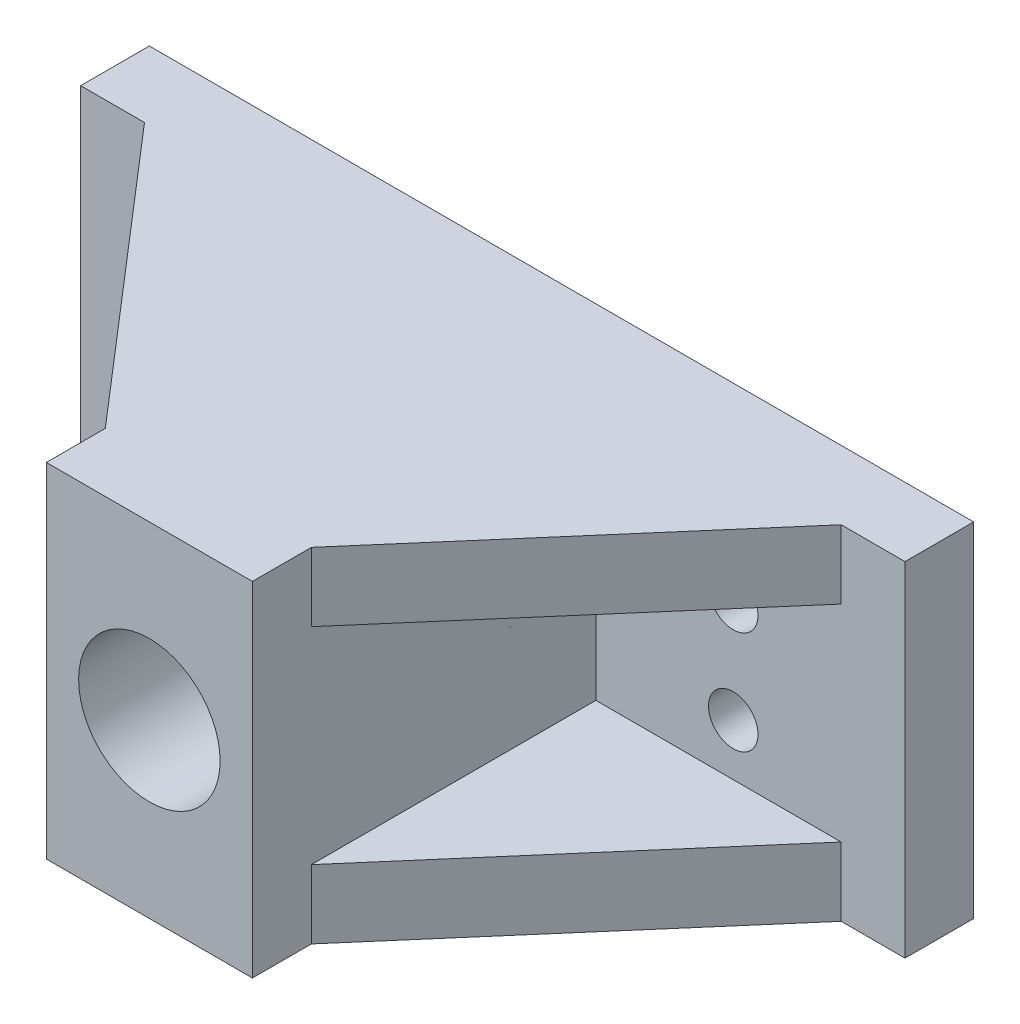
ISO-10303-21;
HEADER;
FILE_DESCRIPTION(('STEP AP214'),'2;1');
FILE_NAME('part.step','',(''),(''),'','','');
FILE_SCHEMA(('AUTOMOTIVE_DESIGN { 1 0 10303 214 1 1 1 1 }'));
ENDSEC;
DATA;
#1=APPLICATION_CONTEXT('core data for automotive mechanical design processes');
#2=APPLICATION_PROTOCOL_DEFINITION('international standard','automotive_design',2000,#1);
#3=PRODUCT_CONTEXT('',#1,'mechanical');
#4=PRODUCT('Part','Part','',(#3));
#5=PRODUCT_RELATED_PRODUCT_CATEGORY('part','',(#4));
#6=PRODUCT_DEFINITION_FORMATION('','',#4);
#7=PRODUCT_DEFINITION_CONTEXT('part definition',#1,'design');
#8=PRODUCT_DEFINITION('design','',#6,#7);
#9=PRODUCT_DEFINITION_SHAPE('','',#8);
#10=(LENGTH_UNIT() NAMED_UNIT(*) SI_UNIT(.MILLI.,.METRE.));
#11=(NAMED_UNIT(*) PLANE_ANGLE_UNIT() SI_UNIT($,.RADIAN.));
#12=(NAMED_UNIT(*) SI_UNIT($,.STERADIAN.) SOLID_ANGLE_UNIT());
#13=UNCERTAINTY_MEASURE_WITH_UNIT(LENGTH_MEASURE(1.E-05),#10,'distance_accuracy_value','');
#14=(GEOMETRIC_REPRESENTATION_CONTEXT(3) GLOBAL_UNCERTAINTY_ASSIGNED_CONTEXT((#13)) GLOBAL_UNIT_ASSIGNED_CONTEXT((#10,
#11,#12)) REPRESENTATION_CONTEXT('',''));
#15=CARTESIAN_POINT('',(0.,0.,0.));
#16=DIRECTION('',(0.,0.,1.));
#17=DIRECTION('',(1.,0.,0.));
#18=AXIS2_PLACEMENT_3D('',#15,#16,#17);
#19=CARTESIAN_POINT('',(0.,0.,5.));
#20=DIRECTION('',(0.,0.,1.));
#21=DIRECTION('',(1.,0.,0.));
#22=AXIS2_PLACEMENT_3D('',#19,#20,#21);
#23=PLANE('',#22);
#24=CARTESIAN_POINT('',(17.5,-3.75,5.));
#25=DIRECTION('',(0.,0.,1.));
#26=DIRECTION('',(1.,0.,0.));
#27=AXIS2_PLACEMENT_3D('',#24,#25,#26);
#28=CIRCLE('',#27,1.8);
#29=CARTESIAN_POINT('',(19.3,-3.75,5.));
#30=VERTEX_POINT('',#29);
#31=EDGE_CURVE('E307',#30,#30,#28,.T.);
#32=ORIENTED_EDGE('',*,*,#31,.F.);
#33=EDGE_LOOP('',(#32));
#34=FACE_BOUND('',#33,.T.);
#35=CARTESIAN_POINT('',(17.5,3.75,5.));
#36=DIRECTION('',(0.,0.,1.));
#37=DIRECTION('',(-1.,0.,0.));
#38=AXIS2_PLACEMENT_3D('',#35,#36,#37);
#39=CIRCLE('',#38,1.8);
#40=CARTESIAN_POINT('',(15.7,3.75,5.));
#41=VERTEX_POINT('',#40);
#42=EDGE_CURVE('E300',#41,#41,#39,.T.);
#43=ORIENTED_EDGE('',*,*,#42,.F.);
#44=EDGE_LOOP('',(#43));
#45=FACE_BOUND('',#44,.T.);
#46=DIRECTION('',(0.,1.,0.));
#47=VECTOR('',#46,1.);
#48=CARTESIAN_POINT('',(25.3552316545314,0.,5.));
#49=LINE('',#48,#47);
#50=CARTESIAN_POINT('',(25.3552316545314,-12.5,5.00000000000001));
#51=VERTEX_POINT('',#50);
#52=CARTESIAN_POINT('',(25.3552316545314,-7.5,5.));
#53=VERTEX_POINT('',#52);
#54=EDGE_CURVE('E278',#51,#53,#49,.T.);
#55=ORIENTED_EDGE('',*,*,#54,.F.);
#56=DIRECTION('',(1.,0.,0.));
#57=VECTOR('',#56,1.);
#58=CARTESIAN_POINT('',(-30.,-12.5,5.));
#59=LINE('',#58,#57);
#60=CARTESIAN_POINT('',(30.,-12.5,5.));
#61=VERTEX_POINT('',#60);
#62=EDGE_CURVE('E178',#51,#61,#59,.T.);
#63=ORIENTED_EDGE('',*,*,#62,.T.);
#64=DIRECTION('',(0.,1.,0.));
#65=VECTOR('',#64,1.);
#66=CARTESIAN_POINT('',(30.,7.50000000000001,5.));
#67=LINE('',#66,#65);
#68=CARTESIAN_POINT('',(30.,12.5,5.));
#69=VERTEX_POINT('',#68);
#70=EDGE_CURVE('E198',#61,#69,#67,.T.);
#71=ORIENTED_EDGE('',*,*,#70,.T.);
#72=DIRECTION('',(-1.,0.,0.));
#73=VECTOR('',#72,1.);
#74=CARTESIAN_POINT('',(-30.,12.5,5.));
#75=LINE('',#74,#73);
#76=CARTESIAN_POINT('',(25.3552316545314,12.5,5.00000000000001));
#77=VERTEX_POINT('',#76);
#78=EDGE_CURVE('E193',#69,#77,#75,.T.);
#79=ORIENTED_EDGE('',*,*,#78,.T.);
#80=DIRECTION('',(0.,-1.,0.));
#81=VECTOR('',#80,1.);
#82=CARTESIAN_POINT('',(25.3552316545314,0.,5.));
#83=LINE('',#82,#81);
#84=CARTESIAN_POINT('',(25.3552316545314,7.5,5.));
#85=VERTEX_POINT('',#84);
#86=EDGE_CURVE('E223',#85,#77,#83,.F.);
#87=ORIENTED_EDGE('',*,*,#86,.F.);
#88=DIRECTION('',(-1.,0.,0.));
#89=VECTOR('',#88,1.);
#90=CARTESIAN_POINT('',(0.,7.5,5.));
#91=LINE('',#90,#89);
#92=CARTESIAN_POINT('',(7.5,7.5,5.));
#93=VERTEX_POINT('',#92);
#94=EDGE_CURVE('E221',#85,#93,#91,.T.);
#95=ORIENTED_EDGE('',*,*,#94,.T.);
#96=DIRECTION('',(0.,1.,0.));
#97=VECTOR('',#96,1.);
#98=CARTESIAN_POINT('',(7.5,7.5,5.));
#99=LINE('',#98,#97);
#100=CARTESIAN_POINT('',(7.5,-7.5,5.));
#101=VERTEX_POINT('',#100);
#102=EDGE_CURVE('E210',#101,#93,#99,.T.);
#103=ORIENTED_EDGE('',*,*,#102,.F.);
#104=DIRECTION('',(1.,0.,0.));
#105=VECTOR('',#104,1.);
#106=CARTESIAN_POINT('',(0.,-7.5,5.));
#107=LINE('',#106,#105);
#108=EDGE_CURVE('E50',#101,#53,#107,.T.);
#109=ORIENTED_EDGE('',*,*,#108,.T.);
#110=EDGE_LOOP('',(#55,#63,#71,#79,#87,#95,#103,#109));
#111=FACE_BOUND('',#110,.T.);
#112=ADVANCED_FACE('F35',(#34,#45,#111),#23,.T.);
#113=CARTESIAN_POINT('',(-17.5,-3.75,5.));
#114=DIRECTION('',(0.,0.,1.));
#115=DIRECTION('',(-1.,0.,0.));
#116=AXIS2_PLACEMENT_3D('',#113,#114,#115);
#117=CIRCLE('',#116,1.8);
#118=CARTESIAN_POINT('',(-19.3,-3.75,5.));
#119=VERTEX_POINT('',#118);
#120=EDGE_CURVE('E313',#119,#119,#117,.T.);
#121=ORIENTED_EDGE('',*,*,#120,.F.);
#122=EDGE_LOOP('',(#121));
#123=FACE_BOUND('',#122,.T.);
#124=CARTESIAN_POINT('',(-17.5,3.75,5.));
#125=DIRECTION('',(0.,0.,1.));
#126=DIRECTION('',(1.,0.,0.));
#127=AXIS2_PLACEMENT_3D('',#124,#125,#126);
#128=CIRCLE('',#127,1.8);
#129=CARTESIAN_POINT('',(-15.7,3.75,5.));
#130=VERTEX_POINT('',#129);
#131=EDGE_CURVE('E294',#130,#130,#128,.T.);
#132=ORIENTED_EDGE('',*,*,#131,.F.);
#133=EDGE_LOOP('',(#132));
#134=FACE_BOUND('',#133,.T.);
#135=DIRECTION('',(0.,1.,0.));
#136=VECTOR('',#135,1.);
#137=CARTESIAN_POINT('',(-25.3552316545314,0.,5.));
#138=LINE('',#137,#136);
#139=CARTESIAN_POINT('',(-25.3552316545314,-7.5,5.));
#140=VERTEX_POINT('',#139);
#141=CARTESIAN_POINT('',(-25.3552316545314,-12.5,5.));
#142=VERTEX_POINT('',#141);
#143=EDGE_CURVE('E149',#140,#142,#138,.F.);
#144=ORIENTED_EDGE('',*,*,#143,.F.);
#145=DIRECTION('',(1.,0.,0.));
#146=VECTOR('',#145,1.);
#147=CARTESIAN_POINT('',(0.,-7.5,5.));
#148=LINE('',#147,#146);
#149=CARTESIAN_POINT('',(-7.5,-7.5,5.));
#150=VERTEX_POINT('',#149);
#151=EDGE_CURVE('E242',#140,#150,#148,.T.);
#152=ORIENTED_EDGE('',*,*,#151,.T.);
#153=DIRECTION('',(0.,-1.,0.));
#154=VECTOR('',#153,1.);
#155=CARTESIAN_POINT('',(-7.5,7.5,5.));
#156=LINE('',#155,#154);
#157=CARTESIAN_POINT('',(-7.5,7.5,5.));
#158=VERTEX_POINT('',#157);
#159=EDGE_CURVE('E206',#158,#150,#156,.T.);
#160=ORIENTED_EDGE('',*,*,#159,.F.);
#161=DIRECTION('',(-1.,0.,0.));
#162=VECTOR('',#161,1.);
#163=CARTESIAN_POINT('',(0.,7.5,5.));
#164=LINE('',#163,#162);
#165=CARTESIAN_POINT('',(-25.3552316545314,7.5,5.));
#166=VERTEX_POINT('',#165);
#167=EDGE_CURVE('E258',#158,#166,#164,.T.);
#168=ORIENTED_EDGE('',*,*,#167,.T.);
#169=DIRECTION('',(0.,-1.,0.));
#170=VECTOR('',#169,1.);
#171=CARTESIAN_POINT('',(-25.3552316545314,0.,5.));
#172=LINE('',#171,#170);
#173=CARTESIAN_POINT('',(-25.3552316545314,12.5,5.));
#174=VERTEX_POINT('',#173);
#175=EDGE_CURVE('E252',#174,#166,#172,.T.);
#176=ORIENTED_EDGE('',*,*,#175,.F.);
#177=CARTESIAN_POINT('',(-30.,12.5,5.));
#178=VERTEX_POINT('',#177);
#179=EDGE_CURVE('E188',#174,#178,#75,.T.);
#180=ORIENTED_EDGE('',*,*,#179,.T.);
#181=DIRECTION('',(0.,-1.,0.));
#182=VECTOR('',#181,1.);
#183=CARTESIAN_POINT('',(-30.,7.5,5.));
#184=LINE('',#183,#182);
#185=CARTESIAN_POINT('',(-30.,-12.5,5.));
#186=VERTEX_POINT('',#185);
#187=EDGE_CURVE('E175',#178,#186,#184,.T.);
#188=ORIENTED_EDGE('',*,*,#187,.T.);
#189=EDGE_CURVE('E168',#186,#142,#59,.T.);
#190=ORIENTED_EDGE('',*,*,#189,.T.);
#191=EDGE_LOOP('',(#144,#152,#160,#168,#176,#180,#188,#190));
#192=FACE_BOUND('',#191,.T.);
#193=ADVANCED_FACE('F173',(#123,#134,#192),#23,.T.);
#194=CARTESIAN_POINT('',(0.,0.,0.));
#195=DIRECTION('',(0.,0.,1.));
#196=DIRECTION('',(1.,0.,0.));
#197=AXIS2_PLACEMENT_3D('',#194,#195,#196);
#198=PLANE('',#197);
#199=CARTESIAN_POINT('',(-17.5,-3.75,0.));
#200=DIRECTION('',(0.,0.,1.));
#201=DIRECTION('',(-1.,0.,0.));
#202=AXIS2_PLACEMENT_3D('',#199,#200,#201);
#203=CIRCLE('',#202,1.8);
#204=CARTESIAN_POINT('',(-19.3,-3.75,0.));
#205=VERTEX_POINT('',#204);
#206=EDGE_CURVE('E297',#205,#205,#203,.T.);
#207=ORIENTED_EDGE('',*,*,#206,.T.);
#208=EDGE_LOOP('',(#207));
#209=FACE_BOUND('',#208,.T.);
#210=CARTESIAN_POINT('',(17.5,-3.75,0.));
#211=DIRECTION('',(0.,0.,1.));
#212=DIRECTION('',(1.,0.,0.));
#213=AXIS2_PLACEMENT_3D('',#210,#211,#212);
#214=CIRCLE('',#213,1.8);
#215=CARTESIAN_POINT('',(19.3,-3.75,0.));
#216=VERTEX_POINT('',#215);
#217=EDGE_CURVE('E310',#216,#216,#214,.T.);
#218=ORIENTED_EDGE('',*,*,#217,.T.);
#219=EDGE_LOOP('',(#218));
#220=FACE_BOUND('',#219,.T.);
#221=CARTESIAN_POINT('',(17.5,3.75,0.));
#222=DIRECTION('',(0.,0.,1.));
#223=DIRECTION('',(-1.,0.,0.));
#224=AXIS2_PLACEMENT_3D('',#221,#222,#223);
#225=CIRCLE('',#224,1.8);
#226=CARTESIAN_POINT('',(15.7,3.75,0.));
#227=VERTEX_POINT('',#226);
#228=EDGE_CURVE('E303',#227,#227,#225,.T.);
#229=ORIENTED_EDGE('',*,*,#228,.T.);
#230=EDGE_LOOP('',(#229));
#231=FACE_BOUND('',#230,.T.);
#232=CARTESIAN_POINT('',(-17.5,3.75,0.));
#233=DIRECTION('',(0.,0.,1.));
#234=DIRECTION('',(1.,0.,0.));
#235=AXIS2_PLACEMENT_3D('',#232,#233,#234);
#236=CIRCLE('',#235,1.8);
#237=CARTESIAN_POINT('',(-15.7,3.75,0.));
#238=VERTEX_POINT('',#237);
#239=EDGE_CURVE('E291',#238,#238,#236,.T.);
#240=ORIENTED_EDGE('',*,*,#239,.T.);
#241=EDGE_LOOP('',(#240));
#242=FACE_BOUND('',#241,.T.);
#243=DIRECTION('',(0.,1.,0.));
#244=VECTOR('',#243,1.);
#245=CARTESIAN_POINT('',(30.,7.50000000000001,0.));
#246=LINE('',#245,#244);
#247=CARTESIAN_POINT('',(30.,-12.5,0.));
#248=VERTEX_POINT('',#247);
#249=CARTESIAN_POINT('',(30.,12.5,0.));
#250=VERTEX_POINT('',#249);
#251=EDGE_CURVE('E201',#248,#250,#246,.T.);
#252=ORIENTED_EDGE('',*,*,#251,.F.);
#253=DIRECTION('',(1.,0.,0.));
#254=VECTOR('',#253,1.);
#255=CARTESIAN_POINT('',(-30.,-12.5,0.));
#256=LINE('',#255,#254);
#257=CARTESIAN_POINT('',(-30.,-12.5,0.));
#258=VERTEX_POINT('',#257);
#259=EDGE_CURVE('E177',#258,#248,#256,.T.);
#260=ORIENTED_EDGE('',*,*,#259,.F.);
#261=DIRECTION('',(0.,-1.,0.));
#262=VECTOR('',#261,1.);
#263=CARTESIAN_POINT('',(-30.,7.5,0.));
#264=LINE('',#263,#262);
#265=CARTESIAN_POINT('',(-30.,12.5,0.));
#266=VERTEX_POINT('',#265);
#267=EDGE_CURVE('E204',#266,#258,#264,.T.);
#268=ORIENTED_EDGE('',*,*,#267,.F.);
#269=DIRECTION('',(-1.,0.,0.));
#270=VECTOR('',#269,1.);
#271=CARTESIAN_POINT('',(-30.,12.5,0.));
#272=LINE('',#271,#270);
#273=EDGE_CURVE('E190',#250,#266,#272,.T.);
#274=ORIENTED_EDGE('',*,*,#273,.F.);
#275=EDGE_LOOP('',(#252,#260,#268,#274));
#276=FACE_BOUND('',#275,.T.);
#277=CARTESIAN_POINT('',(0.,0.,0.));
#278=DIRECTION('',(0.,0.,1.));
#279=DIRECTION('',(1.,0.,0.));
#280=AXIS2_PLACEMENT_3D('',#277,#278,#279);
#281=CIRCLE('',#280,5.15);
#282=CARTESIAN_POINT('',(5.15,0.,0.));
#283=VERTEX_POINT('',#282);
#284=EDGE_CURVE('E11',#283,#283,#281,.T.);
#285=ORIENTED_EDGE('',*,*,#284,.T.);
#286=EDGE_LOOP('',(#285));
#287=FACE_BOUND('',#286,.T.);
#288=ADVANCED_FACE('F37',(#209,#220,#231,#242,#276,#287),#198,.F.);
#289=CARTESIAN_POINT('',(0.,0.,0.));
#290=DIRECTION('',(0.,0.,1.));
#291=DIRECTION('',(1.,0.,0.));
#292=AXIS2_PLACEMENT_3D('',#289,#290,#291);
#293=CYLINDRICAL_SURFACE('',#292,5.15);
#294=ORIENTED_EDGE('',*,*,#284,.F.);
#295=EDGE_LOOP('',(#294));
#296=FACE_BOUND('',#295,.T.);
#297=CARTESIAN_POINT('',(0.,0.,30.));
#298=DIRECTION('',(0.,0.,-1.));
#299=DIRECTION('',(-1.,0.,0.));
#300=AXIS2_PLACEMENT_3D('',#297,#298,#299);
#301=CIRCLE('',#300,5.15);
#302=CARTESIAN_POINT('',(-5.15,0.,30.));
#303=VERTEX_POINT('',#302);
#304=EDGE_CURVE('E304',#303,#303,#301,.T.);
#305=ORIENTED_EDGE('',*,*,#304,.F.);
#306=EDGE_LOOP('',(#305));
#307=FACE_BOUND('',#306,.T.);
#308=ADVANCED_FACE('F323',(#296,#307),#293,.F.);
#309=CARTESIAN_POINT('',(0.,0.,30.));
#310=DIRECTION('',(0.,0.,-1.));
#311=DIRECTION('',(-1.,0.,0.));
#312=AXIS2_PLACEMENT_3D('',#309,#310,#311);
#313=PLANE('',#312);
#314=DIRECTION('',(0.,-1.,0.));
#315=VECTOR('',#314,1.);
#316=CARTESIAN_POINT('',(-7.5,7.5,30.));
#317=LINE('',#316,#315);
#318=CARTESIAN_POINT('',(-7.5,12.5,30.));
#319=VERTEX_POINT('',#318);
#320=CARTESIAN_POINT('',(-7.5,-12.5,30.));
#321=VERTEX_POINT('',#320);
#322=EDGE_CURVE('E208',#319,#321,#317,.T.);
#323=ORIENTED_EDGE('',*,*,#322,.T.);
#324=DIRECTION('',(-1.,0.,0.));
#325=VECTOR('',#324,1.);
#326=CARTESIAN_POINT('',(-7.5,-12.5,30.));
#327=LINE('',#326,#325);
#328=CARTESIAN_POINT('',(7.5,-12.5,30.));
#329=VERTEX_POINT('',#328);
#330=EDGE_CURVE('E261',#329,#321,#327,.T.);
#331=ORIENTED_EDGE('',*,*,#330,.F.);
#332=DIRECTION('',(0.,1.,0.));
#333=VECTOR('',#332,1.);
#334=CARTESIAN_POINT('',(7.5,7.5,30.));
#335=LINE('',#334,#333);
#336=CARTESIAN_POINT('',(7.5,12.5,30.));
#337=VERTEX_POINT('',#336);
#338=EDGE_CURVE('E43',#329,#337,#335,.T.);
#339=ORIENTED_EDGE('',*,*,#338,.T.);
#340=DIRECTION('',(1.,0.,0.));
#341=VECTOR('',#340,1.);
#342=CARTESIAN_POINT('',(-7.5,12.5,30.));
#343=LINE('',#342,#341);
#344=EDGE_CURVE('E182',#319,#337,#343,.T.);
#345=ORIENTED_EDGE('',*,*,#344,.F.);
#346=EDGE_LOOP('',(#323,#331,#339,#345));
#347=FACE_BOUND('',#346,.T.);
#348=ORIENTED_EDGE('',*,*,#304,.T.);
#349=EDGE_LOOP('',(#348));
#350=FACE_BOUND('',#349,.T.);
#351=ADVANCED_FACE('F321',(#347,#350),#313,.F.);
#352=CARTESIAN_POINT('',(-7.5,7.5,30.));
#353=DIRECTION('',(1.,0.,0.));
#354=DIRECTION('',(0.,1.,0.));
#355=AXIS2_PLACEMENT_3D('',#352,#353,#354);
#356=PLANE('',#355);
#357=DIRECTION('',(0.,0.,-1.));
#358=VECTOR('',#357,1.);
#359=CARTESIAN_POINT('',(-7.5,-12.5,45.8113883008419));
#360=LINE('',#359,#358);
#361=CARTESIAN_POINT('',(-7.49999999999998,-12.5,25.7076023988971));
#362=VERTEX_POINT('',#361);
#363=EDGE_CURVE('E171',#321,#362,#360,.T.);
#364=ORIENTED_EDGE('',*,*,#363,.F.);
#365=ORIENTED_EDGE('',*,*,#322,.F.);
#366=DIRECTION('',(0.,0.,-1.));
#367=VECTOR('',#366,1.);
#368=CARTESIAN_POINT('',(-7.5,12.5,45.8113883008419));
#369=LINE('',#368,#367);
#370=CARTESIAN_POINT('',(-7.49999999999999,12.5,25.7076023988971));
#371=VERTEX_POINT('',#370);
#372=EDGE_CURVE('E263',#319,#371,#369,.T.);
#373=ORIENTED_EDGE('',*,*,#372,.T.);
#374=DIRECTION('',(0.,-1.,0.));
#375=VECTOR('',#374,1.);
#376=CARTESIAN_POINT('',(-7.5,7.5,25.7076023988971));
#377=LINE('',#376,#375);
#378=CARTESIAN_POINT('',(-7.5,7.5,25.7076023988971));
#379=VERTEX_POINT('',#378);
#380=EDGE_CURVE('E248',#371,#379,#377,.T.);
#381=ORIENTED_EDGE('',*,*,#380,.T.);
#382=DIRECTION('',(0.,0.,1.));
#383=VECTOR('',#382,1.);
#384=CARTESIAN_POINT('',(-7.5,7.5,30.));
#385=LINE('',#384,#383);
#386=EDGE_CURVE('E255',#158,#379,#385,.T.);
#387=ORIENTED_EDGE('',*,*,#386,.F.);
#388=ORIENTED_EDGE('',*,*,#159,.T.);
#389=DIRECTION('',(0.,0.,-1.));
#390=VECTOR('',#389,1.);
#391=CARTESIAN_POINT('',(-7.5,-7.5,30.));
#392=LINE('',#391,#390);
#393=CARTESIAN_POINT('',(-7.5,-7.5,25.7076023988971));
#394=VERTEX_POINT('',#393);
#395=EDGE_CURVE('E159',#394,#150,#392,.T.);
#396=ORIENTED_EDGE('',*,*,#395,.F.);
#397=DIRECTION('',(0.,1.,0.));
#398=VECTOR('',#397,1.);
#399=CARTESIAN_POINT('',(-7.5,7.5,25.7076023988971));
#400=LINE('',#399,#398);
#401=EDGE_CURVE('E160',#394,#362,#400,.F.);
#402=ORIENTED_EDGE('',*,*,#401,.T.);
#403=EDGE_LOOP('',(#364,#365,#373,#381,#387,#388,#396,#402));
#404=FACE_BOUND('',#403,.T.);
#405=ADVANCED_FACE('F331',(#404),#356,.F.);
#406=CARTESIAN_POINT('',(7.5,7.5,30.));
#407=DIRECTION('',(-1.,0.,0.));
#408=DIRECTION('',(0.,0.,1.));
#409=AXIS2_PLACEMENT_3D('',#406,#407,#408);
#410=PLANE('',#409);
#411=DIRECTION('',(0.,0.,-1.));
#412=VECTOR('',#411,1.);
#413=CARTESIAN_POINT('',(7.5,-12.5,45.8113883008419));
#414=LINE('',#413,#412);
#415=CARTESIAN_POINT('',(7.49999999999999,-12.5,25.7076023988971));
#416=VERTEX_POINT('',#415);
#417=EDGE_CURVE('E260',#329,#416,#414,.T.);
#418=ORIENTED_EDGE('',*,*,#417,.T.);
#419=DIRECTION('',(0.,1.,0.));
#420=VECTOR('',#419,1.);
#421=CARTESIAN_POINT('',(7.5,7.5,25.7076023988971));
#422=LINE('',#421,#420);
#423=CARTESIAN_POINT('',(7.5,-7.5,25.7076023988971));
#424=VERTEX_POINT('',#423);
#425=EDGE_CURVE('E58',#416,#424,#422,.T.);
#426=ORIENTED_EDGE('',*,*,#425,.T.);
#427=DIRECTION('',(0.,0.,1.));
#428=VECTOR('',#427,1.);
#429=CARTESIAN_POINT('',(7.5,-7.5,30.));
#430=LINE('',#429,#428);
#431=EDGE_CURVE('E219',#101,#424,#430,.T.);
#432=ORIENTED_EDGE('',*,*,#431,.F.);
#433=ORIENTED_EDGE('',*,*,#102,.T.);
#434=DIRECTION('',(0.,0.,-1.));
#435=VECTOR('',#434,1.);
#436=CARTESIAN_POINT('',(7.5,7.5,30.));
#437=LINE('',#436,#435);
#438=CARTESIAN_POINT('',(7.5,7.5,25.7076023988971));
#439=VERTEX_POINT('',#438);
#440=EDGE_CURVE('E217',#439,#93,#437,.T.);
#441=ORIENTED_EDGE('',*,*,#440,.F.);
#442=DIRECTION('',(0.,-1.,0.));
#443=VECTOR('',#442,1.);
#444=CARTESIAN_POINT('',(7.5,7.5,25.7076023988971));
#445=LINE('',#444,#443);
#446=CARTESIAN_POINT('',(7.49999999999999,12.5,25.7076023988971));
#447=VERTEX_POINT('',#446);
#448=EDGE_CURVE('E227',#439,#447,#445,.F.);
#449=ORIENTED_EDGE('',*,*,#448,.T.);
#450=DIRECTION('',(0.,0.,-1.));
#451=VECTOR('',#450,1.);
#452=CARTESIAN_POINT('',(7.5,12.5,45.8113883008419));
#453=LINE('',#452,#451);
#454=EDGE_CURVE('E267',#337,#447,#453,.T.);
#455=ORIENTED_EDGE('',*,*,#454,.F.);
#456=ORIENTED_EDGE('',*,*,#338,.F.);
#457=EDGE_LOOP('',(#418,#426,#432,#433,#441,#449,#455,#456));
#458=FACE_BOUND('',#457,.T.);
#459=ADVANCED_FACE('F215',(#458),#410,.F.);
#460=CARTESIAN_POINT('',(-30.,7.5,0.));
#461=DIRECTION('',(-1.,0.,0.));
#462=DIRECTION('',(0.,0.,1.));
#463=AXIS2_PLACEMENT_3D('',#460,#461,#462);
#464=PLANE('',#463);
#465=DIRECTION('',(0.,0.,1.));
#466=VECTOR('',#465,1.);
#467=CARTESIAN_POINT('',(-30.,-12.5,0.));
#468=LINE('',#467,#466);
#469=EDGE_CURVE('E180',#258,#186,#468,.T.);
#470=ORIENTED_EDGE('',*,*,#469,.T.);
#471=ORIENTED_EDGE('',*,*,#187,.F.);
#472=DIRECTION('',(0.,0.,1.));
#473=VECTOR('',#472,1.);
#474=CARTESIAN_POINT('',(-30.,12.5,0.));
#475=LINE('',#474,#473);
#476=EDGE_CURVE('E195',#266,#178,#475,.T.);
#477=ORIENTED_EDGE('',*,*,#476,.F.);
#478=ORIENTED_EDGE('',*,*,#267,.T.);
#479=EDGE_LOOP('',(#470,#471,#477,#478));
#480=FACE_BOUND('',#479,.T.);
#481=ADVANCED_FACE('F397',(#480),#464,.T.);
#482=CARTESIAN_POINT('',(30.,7.50000000000001,0.));
#483=DIRECTION('',(1.,0.,0.));
#484=DIRECTION('',(0.,0.,-1.));
#485=AXIS2_PLACEMENT_3D('',#482,#483,#484);
#486=PLANE('',#485);
#487=ORIENTED_EDGE('',*,*,#251,.T.);
#488=DIRECTION('',(0.,0.,1.));
#489=VECTOR('',#488,1.);
#490=CARTESIAN_POINT('',(30.,12.5,0.));
#491=LINE('',#490,#489);
#492=EDGE_CURVE('E192',#250,#69,#491,.T.);
#493=ORIENTED_EDGE('',*,*,#492,.T.);
#494=ORIENTED_EDGE('',*,*,#70,.F.);
#495=DIRECTION('',(0.,0.,1.));
#496=VECTOR('',#495,1.);
#497=CARTESIAN_POINT('',(30.,-12.5,0.));
#498=LINE('',#497,#496);
#499=EDGE_CURVE('E185',#248,#61,#498,.T.);
#500=ORIENTED_EDGE('',*,*,#499,.F.);
#501=EDGE_LOOP('',(#487,#493,#494,#500));
#502=FACE_BOUND('',#501,.T.);
#503=ADVANCED_FACE('F394',(#502),#486,.T.);
#504=CARTESIAN_POINT('',(-30.,12.5,0.));
#505=DIRECTION('',(0.,1.,0.));
#506=DIRECTION('',(0.,0.,1.));
#507=AXIS2_PLACEMENT_3D('',#504,#505,#506);
#508=PLANE('',#507);
#509=ORIENTED_EDGE('',*,*,#454,.T.);
#510=DIRECTION('',(-0.653020400460944,0.,0.757340317546761));
#511=VECTOR('',#510,1.);
#512=CARTESIAN_POINT('',(25.3552316545314,12.5,5.));
#513=LINE('',#512,#511);
#514=EDGE_CURVE('E231',#77,#447,#513,.T.);
#515=ORIENTED_EDGE('',*,*,#514,.F.);
#516=ORIENTED_EDGE('',*,*,#78,.F.);
#517=ORIENTED_EDGE('',*,*,#492,.F.);
#518=ORIENTED_EDGE('',*,*,#273,.T.);
#519=ORIENTED_EDGE('',*,*,#476,.T.);
#520=ORIENTED_EDGE('',*,*,#179,.F.);
#521=DIRECTION('',(0.653020400460944,0.,0.757340317546761));
#522=VECTOR('',#521,1.);
#523=CARTESIAN_POINT('',(-25.3552316545314,12.5,5.));
#524=LINE('',#523,#522);
#525=EDGE_CURVE('E245',#174,#371,#524,.T.);
#526=ORIENTED_EDGE('',*,*,#525,.T.);
#527=ORIENTED_EDGE('',*,*,#372,.F.);
#528=ORIENTED_EDGE('',*,*,#344,.T.);
#529=EDGE_LOOP('',(#509,#515,#516,#517,#518,#519,#520,#526,#527,#528));
#530=FACE_BOUND('',#529,.T.);
#531=ADVANCED_FACE('F272',(#530),#508,.T.);
#532=CARTESIAN_POINT('',(-30.,-12.5,0.));
#533=DIRECTION('',(0.,-1.,0.));
#534=DIRECTION('',(1.,0.,0.));
#535=AXIS2_PLACEMENT_3D('',#532,#533,#534);
#536=PLANE('',#535);
#537=ORIENTED_EDGE('',*,*,#62,.F.);
#538=DIRECTION('',(-0.653020400460944,0.,0.757340317546761));
#539=VECTOR('',#538,1.);
#540=CARTESIAN_POINT('',(25.3552316545314,-12.5,5.));
#541=LINE('',#540,#539);
#542=EDGE_CURVE('E288',#51,#416,#541,.T.);
#543=ORIENTED_EDGE('',*,*,#542,.T.);
#544=ORIENTED_EDGE('',*,*,#417,.F.);
#545=ORIENTED_EDGE('',*,*,#330,.T.);
#546=ORIENTED_EDGE('',*,*,#363,.T.);
#547=DIRECTION('',(0.653020400460944,0.,0.757340317546761));
#548=VECTOR('',#547,1.);
#549=CARTESIAN_POINT('',(-25.3552316545314,-12.5,5.));
#550=LINE('',#549,#548);
#551=EDGE_CURVE('E152',#142,#362,#550,.T.);
#552=ORIENTED_EDGE('',*,*,#551,.F.);
#553=ORIENTED_EDGE('',*,*,#189,.F.);
#554=ORIENTED_EDGE('',*,*,#469,.F.);
#555=ORIENTED_EDGE('',*,*,#259,.T.);
#556=ORIENTED_EDGE('',*,*,#499,.T.);
#557=EDGE_LOOP('',(#537,#543,#544,#545,#546,#552,#553,#554,#555,#556));
#558=FACE_BOUND('',#557,.T.);
#559=ADVANCED_FACE('F166',(#558),#536,.T.);
#560=CARTESIAN_POINT('',(-25.3552316545314,12.5,5.));
#561=DIRECTION('',(-0.757340317546761,0.,0.653020400460944));
#562=DIRECTION('',(0.653020400460944,0.,0.757340317546761));
#563=AXIS2_PLACEMENT_3D('',#560,#561,#562);
#564=PLANE('',#563);
#565=ORIENTED_EDGE('',*,*,#525,.F.);
#566=ORIENTED_EDGE('',*,*,#175,.T.);
#567=DIRECTION('',(0.653020400460944,0.,0.757340317546761));
#568=VECTOR('',#567,1.);
#569=CARTESIAN_POINT('',(-25.3552316545314,7.5,5.));
#570=LINE('',#569,#568);
#571=EDGE_CURVE('E244',#166,#379,#570,.T.);
#572=ORIENTED_EDGE('',*,*,#571,.T.);
#573=ORIENTED_EDGE('',*,*,#380,.F.);
#574=EDGE_LOOP('',(#565,#566,#572,#573));
#575=FACE_BOUND('',#574,.T.);
#576=ADVANCED_FACE('F385',(#575),#564,.T.);
#577=CARTESIAN_POINT('',(0.,7.5,15.));
#578=DIRECTION('',(0.,1.,0.));
#579=DIRECTION('',(0.,0.,1.));
#580=AXIS2_PLACEMENT_3D('',#577,#578,#579);
#581=PLANE('',#580);
#582=ORIENTED_EDGE('',*,*,#167,.F.);
#583=ORIENTED_EDGE('',*,*,#386,.T.);
#584=ORIENTED_EDGE('',*,*,#571,.F.);
#585=EDGE_LOOP('',(#582,#583,#584));
#586=FACE_BOUND('',#585,.T.);
#587=ADVANCED_FACE('F382',(#586),#581,.F.);
#588=CARTESIAN_POINT('',(-25.3552316545314,-12.5,5.));
#589=DIRECTION('',(0.757340317546761,0.,-0.653020400460944));
#590=DIRECTION('',(0.653020400460944,0.,0.757340317546761));
#591=AXIS2_PLACEMENT_3D('',#588,#589,#590);
#592=PLANE('',#591);
#593=DIRECTION('',(0.653020400460944,0.,0.757340317546761));
#594=VECTOR('',#593,1.);
#595=CARTESIAN_POINT('',(-25.3552316545314,-7.5,5.));
#596=LINE('',#595,#594);
#597=EDGE_CURVE('E155',#140,#394,#596,.T.);
#598=ORIENTED_EDGE('',*,*,#597,.F.);
#599=ORIENTED_EDGE('',*,*,#143,.T.);
#600=ORIENTED_EDGE('',*,*,#551,.T.);
#601=ORIENTED_EDGE('',*,*,#401,.F.);
#602=EDGE_LOOP('',(#598,#599,#600,#601));
#603=FACE_BOUND('',#602,.T.);
#604=ADVANCED_FACE('F151',(#603),#592,.F.);
#605=CARTESIAN_POINT('',(0.,-7.5,15.));
#606=DIRECTION('',(0.,-1.,0.));
#607=DIRECTION('',(1.,0.,0.));
#608=AXIS2_PLACEMENT_3D('',#605,#606,#607);
#609=PLANE('',#608);
#610=ORIENTED_EDGE('',*,*,#151,.F.);
#611=ORIENTED_EDGE('',*,*,#597,.T.);
#612=ORIENTED_EDGE('',*,*,#395,.T.);
#613=EDGE_LOOP('',(#610,#611,#612));
#614=FACE_BOUND('',#613,.T.);
#615=ADVANCED_FACE('F376',(#614),#609,.F.);
#616=CARTESIAN_POINT('',(25.3552316545314,12.5,5.));
#617=DIRECTION('',(-0.757340317546761,0.,-0.653020400460944));
#618=DIRECTION('',(-0.653020400460944,0.,0.757340317546761));
#619=AXIS2_PLACEMENT_3D('',#616,#617,#618);
#620=PLANE('',#619);
#621=DIRECTION('',(-0.653020400460944,0.,0.757340317546761));
#622=VECTOR('',#621,1.);
#623=CARTESIAN_POINT('',(25.3552316545314,7.5,5.));
#624=LINE('',#623,#622);
#625=EDGE_CURVE('E230',#85,#439,#624,.T.);
#626=ORIENTED_EDGE('',*,*,#625,.F.);
#627=ORIENTED_EDGE('',*,*,#86,.T.);
#628=ORIENTED_EDGE('',*,*,#514,.T.);
#629=ORIENTED_EDGE('',*,*,#448,.F.);
#630=EDGE_LOOP('',(#626,#627,#628,#629));
#631=FACE_BOUND('',#630,.T.);
#632=ADVANCED_FACE('F277',(#631),#620,.F.);
#633=CARTESIAN_POINT('',(0.,7.5,15.));
#634=DIRECTION('',(0.,1.,0.));
#635=DIRECTION('',(0.,0.,1.));
#636=AXIS2_PLACEMENT_3D('',#633,#634,#635);
#637=PLANE('',#636);
#638=ORIENTED_EDGE('',*,*,#94,.F.);
#639=ORIENTED_EDGE('',*,*,#625,.T.);
#640=ORIENTED_EDGE('',*,*,#440,.T.);
#641=EDGE_LOOP('',(#638,#639,#640));
#642=FACE_BOUND('',#641,.T.);
#643=ADVANCED_FACE('F229',(#642),#637,.F.);
#644=CARTESIAN_POINT('',(25.3552316545314,-12.5,5.));
#645=DIRECTION('',(0.757340317546761,0.,0.653020400460944));
#646=DIRECTION('',(-0.653020400460944,0.,0.757340317546761));
#647=AXIS2_PLACEMENT_3D('',#644,#645,#646);
#648=PLANE('',#647);
#649=ORIENTED_EDGE('',*,*,#542,.F.);
#650=ORIENTED_EDGE('',*,*,#54,.T.);
#651=DIRECTION('',(-0.653020400460944,0.,0.757340317546761));
#652=VECTOR('',#651,1.);
#653=CARTESIAN_POINT('',(25.3552316545314,-7.5,5.));
#654=LINE('',#653,#652);
#655=EDGE_CURVE('E289',#53,#424,#654,.T.);
#656=ORIENTED_EDGE('',*,*,#655,.T.);
#657=ORIENTED_EDGE('',*,*,#425,.F.);
#658=EDGE_LOOP('',(#649,#650,#656,#657));
#659=FACE_BOUND('',#658,.T.);
#660=ADVANCED_FACE('F368',(#659),#648,.T.);
#661=CARTESIAN_POINT('',(0.,-7.5,15.));
#662=DIRECTION('',(0.,-1.,0.));
#663=DIRECTION('',(1.,0.,0.));
#664=AXIS2_PLACEMENT_3D('',#661,#662,#663);
#665=PLANE('',#664);
#666=ORIENTED_EDGE('',*,*,#108,.F.);
#667=ORIENTED_EDGE('',*,*,#431,.T.);
#668=ORIENTED_EDGE('',*,*,#655,.F.);
#669=EDGE_LOOP('',(#666,#667,#668));
#670=FACE_BOUND('',#669,.T.);
#671=ADVANCED_FACE('F360',(#670),#665,.F.);
#672=CARTESIAN_POINT('',(-17.5,3.75,0.));
#673=DIRECTION('',(0.,0.,1.));
#674=DIRECTION('',(1.,0.,0.));
#675=AXIS2_PLACEMENT_3D('',#672,#673,#674);
#676=CYLINDRICAL_SURFACE('',#675,1.8);
#677=ORIENTED_EDGE('',*,*,#239,.F.);
#678=EDGE_LOOP('',(#677));
#679=FACE_BOUND('',#678,.T.);
#680=ORIENTED_EDGE('',*,*,#131,.T.);
#681=EDGE_LOOP('',(#680));
#682=FACE_BOUND('',#681,.T.);
#683=ADVANCED_FACE('F350',(#679,#682),#676,.F.);
#684=CARTESIAN_POINT('',(17.5,3.75,0.));
#685=DIRECTION('',(0.,0.,1.));
#686=DIRECTION('',(1.,0.,0.));
#687=AXIS2_PLACEMENT_3D('',#684,#685,#686);
#688=CYLINDRICAL_SURFACE('',#687,1.8);
#689=ORIENTED_EDGE('',*,*,#228,.F.);
#690=EDGE_LOOP('',(#689));
#691=FACE_BOUND('',#690,.T.);
#692=ORIENTED_EDGE('',*,*,#42,.T.);
#693=EDGE_LOOP('',(#692));
#694=FACE_BOUND('',#693,.T.);
#695=ADVANCED_FACE('F347',(#691,#694),#688,.F.);
#696=CARTESIAN_POINT('',(17.5,-3.75,0.));
#697=DIRECTION('',(0.,0.,1.));
#698=DIRECTION('',(1.,0.,0.));
#699=AXIS2_PLACEMENT_3D('',#696,#697,#698);
#700=CYLINDRICAL_SURFACE('',#699,1.8);
#701=ORIENTED_EDGE('',*,*,#217,.F.);
#702=EDGE_LOOP('',(#701));
#703=FACE_BOUND('',#702,.T.);
#704=ORIENTED_EDGE('',*,*,#31,.T.);
#705=EDGE_LOOP('',(#704));
#706=FACE_BOUND('',#705,.T.);
#707=ADVANCED_FACE('F349',(#703,#706),#700,.F.);
#708=CARTESIAN_POINT('',(-17.5,-3.75,0.));
#709=DIRECTION('',(0.,0.,1.));
#710=DIRECTION('',(1.,0.,0.));
#711=AXIS2_PLACEMENT_3D('',#708,#709,#710);
#712=CYLINDRICAL_SURFACE('',#711,1.8);
#713=ORIENTED_EDGE('',*,*,#206,.F.);
#714=EDGE_LOOP('',(#713));
#715=FACE_BOUND('',#714,.T.);
#716=ORIENTED_EDGE('',*,*,#120,.T.);
#717=EDGE_LOOP('',(#716));
#718=FACE_BOUND('',#717,.T.);
#719=ADVANCED_FACE('F357',(#715,#718),#712,.F.);
#720=CLOSED_SHELL('',(#112,#193,#288,#308,#351,#405,#459,#481,#503,#531,#559,#576,#587,#604,
#615,#632,#643,#660,#671,#683,#695,#707,#719));
#721=MANIFOLD_SOLID_BREP('B2',#720);
#722=ADVANCED_BREP_SHAPE_REPRESENTATION('',(#18,#721),#14);
#723=SHAPE_DEFINITION_REPRESENTATION(#9,#722);
ENDSEC;
END-ISO-10303-21;
